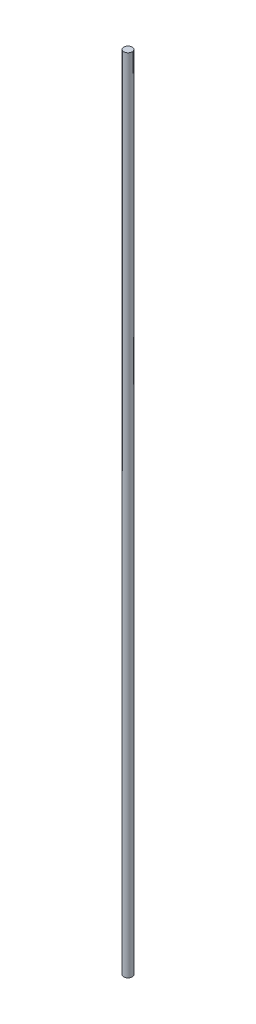
ISO-10303-21;
HEADER;
FILE_DESCRIPTION(('STEP AP214'),'2;1');
FILE_NAME('part.step','',(''),(''),'','','');
FILE_SCHEMA(('AUTOMOTIVE_DESIGN { 1 0 10303 214 1 1 1 1 }'));
ENDSEC;
DATA;
#1=APPLICATION_CONTEXT('core data for automotive mechanical design processes');
#2=APPLICATION_PROTOCOL_DEFINITION('international standard','automotive_design',2000,#1);
#3=PRODUCT_CONTEXT('',#1,'mechanical');
#4=PRODUCT('Part','Part','',(#3));
#5=PRODUCT_RELATED_PRODUCT_CATEGORY('part','',(#4));
#6=PRODUCT_DEFINITION_FORMATION('','',#4);
#7=PRODUCT_DEFINITION_CONTEXT('part definition',#1,'design');
#8=PRODUCT_DEFINITION('design','',#6,#7);
#9=PRODUCT_DEFINITION_SHAPE('','',#8);
#10=(LENGTH_UNIT() NAMED_UNIT(*) SI_UNIT(.MILLI.,.METRE.));
#11=(NAMED_UNIT(*) PLANE_ANGLE_UNIT() SI_UNIT($,.RADIAN.));
#12=(NAMED_UNIT(*) SI_UNIT($,.STERADIAN.) SOLID_ANGLE_UNIT());
#13=UNCERTAINTY_MEASURE_WITH_UNIT(LENGTH_MEASURE(1.E-05),#10,'distance_accuracy_value','');
#14=(GEOMETRIC_REPRESENTATION_CONTEXT(3) GLOBAL_UNCERTAINTY_ASSIGNED_CONTEXT((#13)) GLOBAL_UNIT_ASSIGNED_CONTEXT((#10,
#11,#12)) REPRESENTATION_CONTEXT('',''));
#15=CARTESIAN_POINT('',(0.,0.,0.));
#16=DIRECTION('',(0.,0.,1.));
#17=DIRECTION('',(1.,0.,0.));
#18=AXIS2_PLACEMENT_3D('',#15,#16,#17);
#19=CARTESIAN_POINT('',(0.,304.8,0.));
#20=DIRECTION('',(0.,-1.,0.));
#21=DIRECTION('',(0.,0.,-1.));
#22=AXIS2_PLACEMENT_3D('',#19,#20,#21);
#23=CYLINDRICAL_SURFACE('',#22,1.5875);
#24=CARTESIAN_POINT('',(0.,304.8,0.));
#25=DIRECTION('',(0.,1.,0.));
#26=DIRECTION('',(0.,0.,1.));
#27=AXIS2_PLACEMENT_3D('',#24,#25,#26);
#28=CIRCLE('',#27,1.5875);
#29=CARTESIAN_POINT('',(0.,304.8,1.5875));
#30=VERTEX_POINT('',#29);
#31=EDGE_CURVE('E10',#30,#30,#28,.T.);
#32=ORIENTED_EDGE('',*,*,#31,.F.);
#33=EDGE_LOOP('',(#32));
#34=FACE_BOUND('',#33,.T.);
#35=CARTESIAN_POINT('',(0.,0.,0.));
#36=DIRECTION('',(0.,1.,0.));
#37=DIRECTION('',(0.,0.,1.));
#38=AXIS2_PLACEMENT_3D('',#35,#36,#37);
#39=CIRCLE('',#38,1.5875);
#40=CARTESIAN_POINT('',(0.,0.,1.5875));
#41=VERTEX_POINT('',#40);
#42=EDGE_CURVE('E34',#41,#41,#39,.T.);
#43=ORIENTED_EDGE('',*,*,#42,.T.);
#44=EDGE_LOOP('',(#43));
#45=FACE_BOUND('',#44,.T.);
#46=ADVANCED_FACE('F31',(#34,#45),#23,.T.);
#47=CARTESIAN_POINT('',(0.,304.8,0.));
#48=DIRECTION('',(0.,1.,0.));
#49=DIRECTION('',(0.,0.,1.));
#50=AXIS2_PLACEMENT_3D('',#47,#48,#49);
#51=PLANE('',#50);
#52=ORIENTED_EDGE('',*,*,#31,.T.);
#53=EDGE_LOOP('',(#52));
#54=FACE_BOUND('',#53,.T.);
#55=ADVANCED_FACE('F46',(#54),#51,.T.);
#56=CARTESIAN_POINT('',(0.,0.,0.));
#57=DIRECTION('',(0.,1.,0.));
#58=DIRECTION('',(0.,0.,1.));
#59=AXIS2_PLACEMENT_3D('',#56,#57,#58);
#60=PLANE('',#59);
#61=ORIENTED_EDGE('',*,*,#42,.F.);
#62=EDGE_LOOP('',(#61));
#63=FACE_BOUND('',#62,.T.);
#64=ADVANCED_FACE('F44',(#63),#60,.F.);
#65=CLOSED_SHELL('',(#46,#55,#64));
#66=MANIFOLD_SOLID_BREP('B2',#65);
#67=ADVANCED_BREP_SHAPE_REPRESENTATION('',(#18,#66),#14);
#68=SHAPE_DEFINITION_REPRESENTATION(#9,#67);
ENDSEC;
END-ISO-10303-21;
